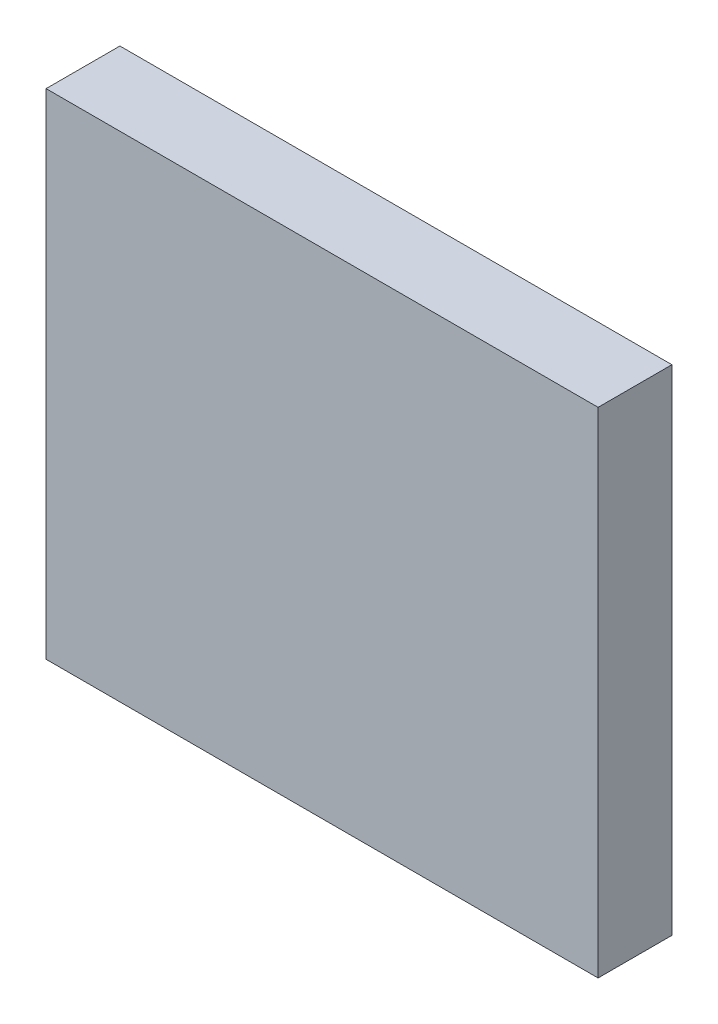
ISO-10303-21;
HEADER;
FILE_DESCRIPTION(('STEP AP214'),'2;1');
FILE_NAME('part.step','',(''),(''),'','','');
FILE_SCHEMA(('AUTOMOTIVE_DESIGN { 1 0 10303 214 1 1 1 1 }'));
ENDSEC;
DATA;
#1=APPLICATION_CONTEXT('core data for automotive mechanical design processes');
#2=APPLICATION_PROTOCOL_DEFINITION('international standard','automotive_design',2000,#1);
#3=PRODUCT_CONTEXT('',#1,'mechanical');
#4=PRODUCT('Part','Part','',(#3));
#5=PRODUCT_RELATED_PRODUCT_CATEGORY('part','',(#4));
#6=PRODUCT_DEFINITION_FORMATION('','',#4);
#7=PRODUCT_DEFINITION_CONTEXT('part definition',#1,'design');
#8=PRODUCT_DEFINITION('design','',#6,#7);
#9=PRODUCT_DEFINITION_SHAPE('','',#8);
#10=(LENGTH_UNIT() NAMED_UNIT(*) SI_UNIT(.MILLI.,.METRE.));
#11=(NAMED_UNIT(*) PLANE_ANGLE_UNIT() SI_UNIT($,.RADIAN.));
#12=(NAMED_UNIT(*) SI_UNIT($,.STERADIAN.) SOLID_ANGLE_UNIT());
#13=UNCERTAINTY_MEASURE_WITH_UNIT(LENGTH_MEASURE(1.E-05),#10,'distance_accuracy_value','');
#14=(GEOMETRIC_REPRESENTATION_CONTEXT(3) GLOBAL_UNCERTAINTY_ASSIGNED_CONTEXT((#13)) GLOBAL_UNIT_ASSIGNED_CONTEXT((#10,
#11,#12)) REPRESENTATION_CONTEXT('',''));
#15=CARTESIAN_POINT('',(0.,0.,0.));
#16=DIRECTION('',(0.,0.,1.));
#17=DIRECTION('',(1.,0.,0.));
#18=AXIS2_PLACEMENT_3D('',#15,#16,#17);
#19=CARTESIAN_POINT('',(-8.6,7.7,2.3));
#20=DIRECTION('',(1.,0.,0.));
#21=DIRECTION('',(0.,1.,0.));
#22=AXIS2_PLACEMENT_3D('',#19,#20,#21);
#23=PLANE('',#22);
#24=DIRECTION('',(0.,-1.,0.));
#25=VECTOR('',#24,1.);
#26=CARTESIAN_POINT('',(-8.6,7.7,0.));
#27=LINE('',#26,#25);
#28=CARTESIAN_POINT('',(-8.6,7.7,0.));
#29=VERTEX_POINT('',#28);
#30=CARTESIAN_POINT('',(-8.6,-7.7,0.));
#31=VERTEX_POINT('',#30);
#32=EDGE_CURVE('E111',#29,#31,#27,.T.);
#33=ORIENTED_EDGE('',*,*,#32,.T.);
#34=DIRECTION('',(0.,0.,-1.));
#35=VECTOR('',#34,1.);
#36=CARTESIAN_POINT('',(-8.6,-7.7,2.3));
#37=LINE('',#36,#35);
#38=CARTESIAN_POINT('',(-8.6,-7.7,2.3));
#39=VERTEX_POINT('',#38);
#40=EDGE_CURVE('E11',#39,#31,#37,.T.);
#41=ORIENTED_EDGE('',*,*,#40,.F.);
#42=DIRECTION('',(0.,-1.,0.));
#43=VECTOR('',#42,1.);
#44=CARTESIAN_POINT('',(-8.6,7.7,2.3));
#45=LINE('',#44,#43);
#46=CARTESIAN_POINT('',(-8.6,7.7,2.3));
#47=VERTEX_POINT('',#46);
#48=EDGE_CURVE('E95',#47,#39,#45,.T.);
#49=ORIENTED_EDGE('',*,*,#48,.F.);
#50=DIRECTION('',(0.,0.,-1.));
#51=VECTOR('',#50,1.);
#52=CARTESIAN_POINT('',(-8.6,7.7,2.3));
#53=LINE('',#52,#51);
#54=EDGE_CURVE('E107',#47,#29,#53,.T.);
#55=ORIENTED_EDGE('',*,*,#54,.T.);
#56=EDGE_LOOP('',(#33,#41,#49,#55));
#57=FACE_BOUND('',#56,.T.);
#58=ADVANCED_FACE('F43',(#57),#23,.F.);
#59=CARTESIAN_POINT('',(-8.6,-7.7,2.3));
#60=DIRECTION('',(0.,1.,0.));
#61=DIRECTION('',(-1.,0.,0.));
#62=AXIS2_PLACEMENT_3D('',#59,#60,#61);
#63=PLANE('',#62);
#64=DIRECTION('',(1.,0.,0.));
#65=VECTOR('',#64,1.);
#66=CARTESIAN_POINT('',(-8.6,-7.7,0.));
#67=LINE('',#66,#65);
#68=CARTESIAN_POINT('',(8.6,-7.7,0.));
#69=VERTEX_POINT('',#68);
#70=EDGE_CURVE('E100',#31,#69,#67,.T.);
#71=ORIENTED_EDGE('',*,*,#70,.T.);
#72=DIRECTION('',(0.,0.,-1.));
#73=VECTOR('',#72,1.);
#74=CARTESIAN_POINT('',(8.6,-7.7,2.3));
#75=LINE('',#74,#73);
#76=CARTESIAN_POINT('',(8.6,-7.7,2.3));
#77=VERTEX_POINT('',#76);
#78=EDGE_CURVE('E52',#77,#69,#75,.T.);
#79=ORIENTED_EDGE('',*,*,#78,.F.);
#80=DIRECTION('',(1.,0.,0.));
#81=VECTOR('',#80,1.);
#82=CARTESIAN_POINT('',(-8.6,-7.7,2.3));
#83=LINE('',#82,#81);
#84=EDGE_CURVE('E90',#39,#77,#83,.T.);
#85=ORIENTED_EDGE('',*,*,#84,.F.);
#86=ORIENTED_EDGE('',*,*,#40,.T.);
#87=EDGE_LOOP('',(#71,#79,#85,#86));
#88=FACE_BOUND('',#87,.T.);
#89=ADVANCED_FACE('F99',(#88),#63,.F.);
#90=CARTESIAN_POINT('',(8.6,7.7,2.3));
#91=DIRECTION('',(-1.,0.,0.));
#92=DIRECTION('',(0.,-1.,0.));
#93=AXIS2_PLACEMENT_3D('',#90,#91,#92);
#94=PLANE('',#93);
#95=DIRECTION('',(0.,1.,0.));
#96=VECTOR('',#95,1.);
#97=CARTESIAN_POINT('',(8.6,7.7,0.));
#98=LINE('',#97,#96);
#99=CARTESIAN_POINT('',(8.6,7.7,0.));
#100=VERTEX_POINT('',#99);
#101=EDGE_CURVE('E77',#69,#100,#98,.T.);
#102=ORIENTED_EDGE('',*,*,#101,.T.);
#103=DIRECTION('',(0.,0.,-1.));
#104=VECTOR('',#103,1.);
#105=CARTESIAN_POINT('',(8.6,7.7,2.3));
#106=LINE('',#105,#104);
#107=CARTESIAN_POINT('',(8.6,7.7,2.3));
#108=VERTEX_POINT('',#107);
#109=EDGE_CURVE('E102',#108,#100,#106,.T.);
#110=ORIENTED_EDGE('',*,*,#109,.F.);
#111=DIRECTION('',(0.,1.,0.));
#112=VECTOR('',#111,1.);
#113=CARTESIAN_POINT('',(8.6,7.7,2.3));
#114=LINE('',#113,#112);
#115=EDGE_CURVE('E93',#77,#108,#114,.T.);
#116=ORIENTED_EDGE('',*,*,#115,.F.);
#117=ORIENTED_EDGE('',*,*,#78,.T.);
#118=EDGE_LOOP('',(#102,#110,#116,#117));
#119=FACE_BOUND('',#118,.T.);
#120=ADVANCED_FACE('F103',(#119),#94,.F.);
#121=CARTESIAN_POINT('',(-8.6,7.7,2.3));
#122=DIRECTION('',(0.,-1.,0.));
#123=DIRECTION('',(0.,0.,-1.));
#124=AXIS2_PLACEMENT_3D('',#121,#122,#123);
#125=PLANE('',#124);
#126=DIRECTION('',(-1.,0.,0.));
#127=VECTOR('',#126,1.);
#128=CARTESIAN_POINT('',(-8.6,7.7,0.));
#129=LINE('',#128,#127);
#130=EDGE_CURVE('E83',#100,#29,#129,.T.);
#131=ORIENTED_EDGE('',*,*,#130,.T.);
#132=ORIENTED_EDGE('',*,*,#54,.F.);
#133=DIRECTION('',(-1.,0.,0.));
#134=VECTOR('',#133,1.);
#135=CARTESIAN_POINT('',(-8.6,7.7,2.3));
#136=LINE('',#135,#134);
#137=EDGE_CURVE('E60',#108,#47,#136,.T.);
#138=ORIENTED_EDGE('',*,*,#137,.F.);
#139=ORIENTED_EDGE('',*,*,#109,.T.);
#140=EDGE_LOOP('',(#131,#132,#138,#139));
#141=FACE_BOUND('',#140,.T.);
#142=ADVANCED_FACE('F124',(#141),#125,.F.);
#143=CARTESIAN_POINT('',(0.,0.,2.3));
#144=DIRECTION('',(0.,0.,1.));
#145=DIRECTION('',(1.,0.,0.));
#146=AXIS2_PLACEMENT_3D('',#143,#144,#145);
#147=PLANE('',#146);
#148=ORIENTED_EDGE('',*,*,#48,.T.);
#149=ORIENTED_EDGE('',*,*,#84,.T.);
#150=ORIENTED_EDGE('',*,*,#115,.T.);
#151=ORIENTED_EDGE('',*,*,#137,.T.);
#152=EDGE_LOOP('',(#148,#149,#150,#151));
#153=FACE_BOUND('',#152,.T.);
#154=ADVANCED_FACE('F91',(#153),#147,.T.);
#155=CARTESIAN_POINT('',(0.,0.,0.));
#156=DIRECTION('',(0.,0.,1.));
#157=DIRECTION('',(1.,0.,0.));
#158=AXIS2_PLACEMENT_3D('',#155,#156,#157);
#159=PLANE('',#158);
#160=ORIENTED_EDGE('',*,*,#32,.F.);
#161=ORIENTED_EDGE('',*,*,#130,.F.);
#162=ORIENTED_EDGE('',*,*,#101,.F.);
#163=ORIENTED_EDGE('',*,*,#70,.F.);
#164=EDGE_LOOP('',(#160,#161,#162,#163));
#165=FACE_BOUND('',#164,.T.);
#166=ADVANCED_FACE('F127',(#165),#159,.F.);
#167=CLOSED_SHELL('',(#58,#89,#120,#142,#154,#166));
#168=MANIFOLD_SOLID_BREP('B2',#167);
#169=ADVANCED_BREP_SHAPE_REPRESENTATION('',(#18,#168),#14);
#170=SHAPE_DEFINITION_REPRESENTATION(#9,#169);
ENDSEC;
END-ISO-10303-21;
